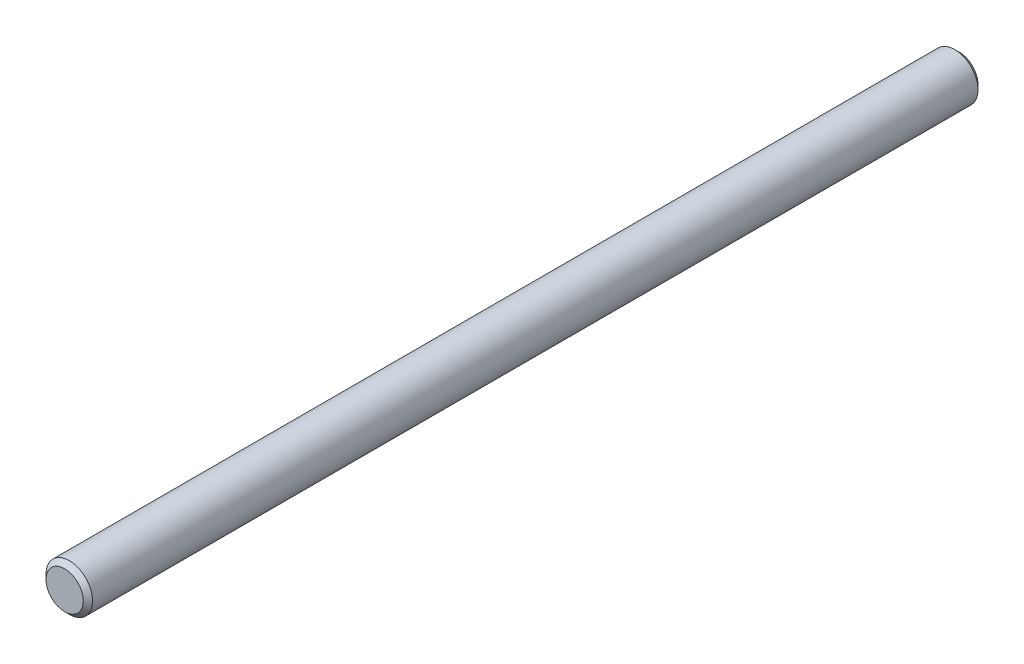
ISO-10303-21;
HEADER;
FILE_DESCRIPTION(('STEP AP214'),'2;1');
FILE_NAME('part.step','',(''),(''),'','','');
FILE_SCHEMA(('AUTOMOTIVE_DESIGN { 1 0 10303 214 1 1 1 1 }'));
ENDSEC;
DATA;
#1=APPLICATION_CONTEXT('core data for automotive mechanical design processes');
#2=APPLICATION_PROTOCOL_DEFINITION('international standard','automotive_design',2000,#1);
#3=PRODUCT_CONTEXT('',#1,'mechanical');
#4=PRODUCT('Part','Part','',(#3));
#5=PRODUCT_RELATED_PRODUCT_CATEGORY('part','',(#4));
#6=PRODUCT_DEFINITION_FORMATION('','',#4);
#7=PRODUCT_DEFINITION_CONTEXT('part definition',#1,'design');
#8=PRODUCT_DEFINITION('design','',#6,#7);
#9=PRODUCT_DEFINITION_SHAPE('','',#8);
#10=(LENGTH_UNIT() NAMED_UNIT(*) SI_UNIT(.MILLI.,.METRE.));
#11=(NAMED_UNIT(*) PLANE_ANGLE_UNIT() SI_UNIT($,.RADIAN.));
#12=(NAMED_UNIT(*) SI_UNIT($,.STERADIAN.) SOLID_ANGLE_UNIT());
#13=UNCERTAINTY_MEASURE_WITH_UNIT(LENGTH_MEASURE(1.E-05),#10,'distance_accuracy_value','');
#14=(GEOMETRIC_REPRESENTATION_CONTEXT(3) GLOBAL_UNCERTAINTY_ASSIGNED_CONTEXT((#13)) GLOBAL_UNIT_ASSIGNED_CONTEXT((#10,
#11,#12)) REPRESENTATION_CONTEXT('',''));
#15=CARTESIAN_POINT('',(0.,0.,0.));
#16=DIRECTION('',(0.,0.,1.));
#17=DIRECTION('',(1.,0.,0.));
#18=AXIS2_PLACEMENT_3D('',#15,#16,#17);
#19=CARTESIAN_POINT('',(0.,0.,76.2));
#20=DIRECTION('',(0.,0.,-1.));
#21=DIRECTION('',(-1.,0.,0.));
#22=AXIS2_PLACEMENT_3D('',#19,#20,#21);
#23=CYLINDRICAL_SURFACE('',#22,3.96875);
#24=CARTESIAN_POINT('',(0.,0.,-75.4062499999998));
#25=DIRECTION('',(0.,0.,1.));
#26=DIRECTION('',(1.,0.,0.));
#27=AXIS2_PLACEMENT_3D('',#24,#25,#26);
#28=CIRCLE('',#27,3.96875);
#29=CARTESIAN_POINT('',(3.96875,0.,-75.4062499999998));
#30=VERTEX_POINT('',#29);
#31=EDGE_CURVE('E55',#30,#30,#28,.T.);
#32=ORIENTED_EDGE('',*,*,#31,.T.);
#33=EDGE_LOOP('',(#32));
#34=FACE_BOUND('',#33,.T.);
#35=CARTESIAN_POINT('',(0.,0.,75.4062500000001));
#36=DIRECTION('',(0.,0.,1.));
#37=DIRECTION('',(1.,0.,0.));
#38=AXIS2_PLACEMENT_3D('',#35,#36,#37);
#39=CIRCLE('',#38,3.96875);
#40=CARTESIAN_POINT('',(3.96875,0.,75.4062500000001));
#41=VERTEX_POINT('',#40);
#42=EDGE_CURVE('E61',#41,#41,#39,.F.);
#43=ORIENTED_EDGE('',*,*,#42,.T.);
#44=EDGE_LOOP('',(#43));
#45=FACE_BOUND('',#44,.T.);
#46=ADVANCED_FACE('F41',(#34,#45),#23,.T.);
#47=CARTESIAN_POINT('',(0.,0.,76.2));
#48=DIRECTION('',(0.,0.,1.));
#49=DIRECTION('',(1.,0.,0.));
#50=AXIS2_PLACEMENT_3D('',#47,#48,#49);
#51=PLANE('',#50);
#52=CARTESIAN_POINT('',(0.,0.,76.2));
#53=DIRECTION('',(0.,0.,1.));
#54=DIRECTION('',(1.,0.,0.));
#55=AXIS2_PLACEMENT_3D('',#52,#53,#54);
#56=CIRCLE('',#55,3.17500000000007);
#57=CARTESIAN_POINT('',(3.17500000000007,0.,76.2));
#58=VERTEX_POINT('',#57);
#59=EDGE_CURVE('E10',#58,#58,#56,.T.);
#60=ORIENTED_EDGE('',*,*,#59,.T.);
#61=EDGE_LOOP('',(#60));
#62=FACE_BOUND('',#61,.T.);
#63=ADVANCED_FACE('F79',(#62),#51,.T.);
#64=CARTESIAN_POINT('',(0.,0.,-76.2));
#65=DIRECTION('',(0.,0.,1.));
#66=DIRECTION('',(1.,0.,0.));
#67=AXIS2_PLACEMENT_3D('',#64,#65,#66);
#68=PLANE('',#67);
#69=CARTESIAN_POINT('',(0.,0.,-76.2));
#70=DIRECTION('',(0.,0.,1.));
#71=DIRECTION('',(1.,0.,0.));
#72=AXIS2_PLACEMENT_3D('',#69,#70,#71);
#73=CIRCLE('',#72,3.17499999999982);
#74=CARTESIAN_POINT('',(3.17499999999982,0.,-76.2));
#75=VERTEX_POINT('',#74);
#76=EDGE_CURVE('E49',#75,#75,#73,.F.);
#77=ORIENTED_EDGE('',*,*,#76,.T.);
#78=EDGE_LOOP('',(#77));
#79=FACE_BOUND('',#78,.T.);
#80=ADVANCED_FACE('F76',(#79),#68,.F.);
#81=CARTESIAN_POINT('',(0.,0.,-75.4062499999998));
#82=DIRECTION('',(0.,0.,1.));
#83=DIRECTION('',(1.,0.,0.));
#84=AXIS2_PLACEMENT_3D('',#81,#82,#83);
#85=CONICAL_SURFACE('',#84,3.96875,0.785398163397453);
#86=ORIENTED_EDGE('',*,*,#76,.F.);
#87=EDGE_LOOP('',(#86));
#88=FACE_BOUND('',#87,.T.);
#89=ORIENTED_EDGE('',*,*,#31,.F.);
#90=EDGE_LOOP('',(#89));
#91=FACE_BOUND('',#90,.T.);
#92=ADVANCED_FACE('F72',(#88,#91),#85,.T.);
#93=CARTESIAN_POINT('',(0.,0.,76.2));
#94=DIRECTION('',(0.,0.,-1.));
#95=DIRECTION('',(-1.,0.,0.));
#96=AXIS2_PLACEMENT_3D('',#93,#94,#95);
#97=CONICAL_SURFACE('',#96,3.17500000000007,0.785398163397445);
#98=ORIENTED_EDGE('',*,*,#42,.F.);
#99=EDGE_LOOP('',(#98));
#100=FACE_BOUND('',#99,.T.);
#101=ORIENTED_EDGE('',*,*,#59,.F.);
#102=EDGE_LOOP('',(#101));
#103=FACE_BOUND('',#102,.T.);
#104=ADVANCED_FACE('F43',(#100,#103),#97,.T.);
#105=CLOSED_SHELL('',(#46,#63,#80,#92,#104));
#106=MANIFOLD_SOLID_BREP('B2',#105);
#107=ADVANCED_BREP_SHAPE_REPRESENTATION('',(#18,#106),#14);
#108=SHAPE_DEFINITION_REPRESENTATION(#9,#107);
ENDSEC;
END-ISO-10303-21;
